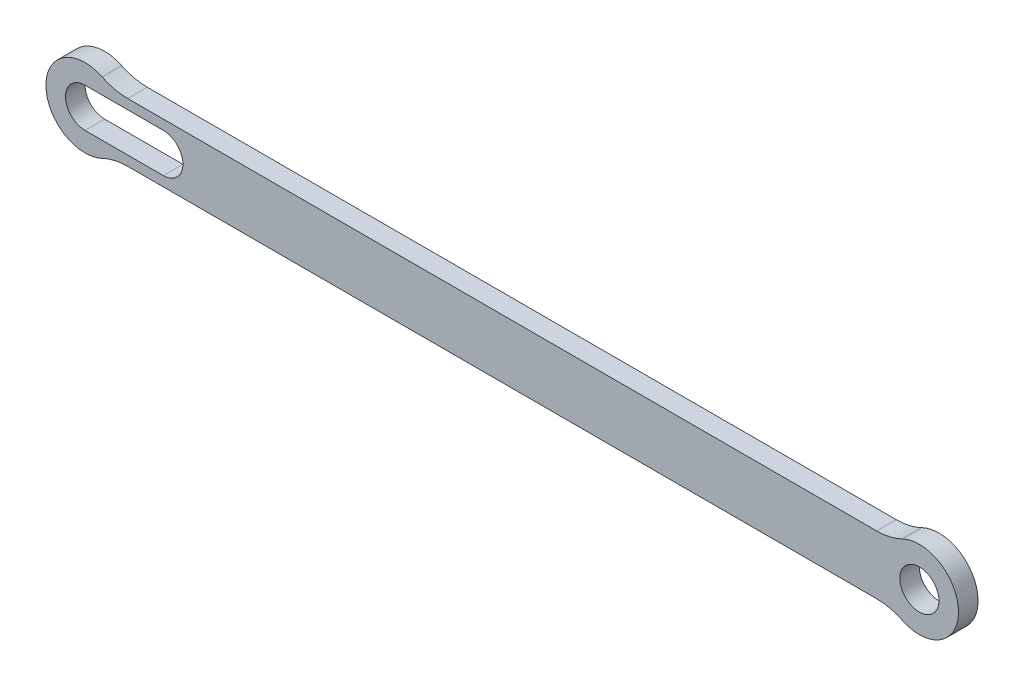
ISO-10303-21;
HEADER;
FILE_DESCRIPTION(('STEP AP214'),'2;1');
FILE_NAME('part.step','',(''),(''),'','','');
FILE_SCHEMA(('AUTOMOTIVE_DESIGN { 1 0 10303 214 1 1 1 1 }'));
ENDSEC;
DATA;
#1=APPLICATION_CONTEXT('core data for automotive mechanical design processes');
#2=APPLICATION_PROTOCOL_DEFINITION('international standard','automotive_design',2000,#1);
#3=PRODUCT_CONTEXT('',#1,'mechanical');
#4=PRODUCT('Part','Part','',(#3));
#5=PRODUCT_RELATED_PRODUCT_CATEGORY('part','',(#4));
#6=PRODUCT_DEFINITION_FORMATION('','',#4);
#7=PRODUCT_DEFINITION_CONTEXT('part definition',#1,'design');
#8=PRODUCT_DEFINITION('design','',#6,#7);
#9=PRODUCT_DEFINITION_SHAPE('','',#8);
#10=(LENGTH_UNIT() NAMED_UNIT(*) SI_UNIT(.MILLI.,.METRE.));
#11=(NAMED_UNIT(*) PLANE_ANGLE_UNIT() SI_UNIT($,.RADIAN.));
#12=(NAMED_UNIT(*) SI_UNIT($,.STERADIAN.) SOLID_ANGLE_UNIT());
#13=UNCERTAINTY_MEASURE_WITH_UNIT(LENGTH_MEASURE(1.E-05),#10,'distance_accuracy_value','');
#14=(GEOMETRIC_REPRESENTATION_CONTEXT(3) GLOBAL_UNCERTAINTY_ASSIGNED_CONTEXT((#13)) GLOBAL_UNIT_ASSIGNED_CONTEXT((#10,
#11,#12)) REPRESENTATION_CONTEXT('',''));
#15=CARTESIAN_POINT('',(0.,0.,0.));
#16=DIRECTION('',(0.,0.,1.));
#17=DIRECTION('',(1.,0.,0.));
#18=AXIS2_PLACEMENT_3D('',#15,#16,#17);
#19=CARTESIAN_POINT('',(-10.8972473588517,22.5,5.));
#20=DIRECTION('',(0.,0.,-1.));
#21=DIRECTION('',(-1.,0.,0.));
#22=AXIS2_PLACEMENT_3D('',#19,#20,#21);
#23=PLANE('',#22);
#24=CARTESIAN_POINT('',(0.,0.,5.));
#25=DIRECTION('',(0.,0.,1.));
#26=DIRECTION('',(1.,0.,0.));
#27=AXIS2_PLACEMENT_3D('',#24,#25,#26);
#28=CIRCLE('',#27,5.);
#29=CARTESIAN_POINT('',(5.,0.,5.));
#30=VERTEX_POINT('',#29);
#31=EDGE_CURVE('E161',#30,#30,#28,.T.);
#32=ORIENTED_EDGE('',*,*,#31,.F.);
#33=EDGE_LOOP('',(#32));
#34=FACE_BOUND('',#33,.T.);
#35=CARTESIAN_POINT('',(-10.8972473588517,22.5,5.));
#36=DIRECTION('',(0.,0.,-1.));
#37=DIRECTION('',(-1.,0.,0.));
#38=AXIS2_PLACEMENT_3D('',#35,#36,#37);
#39=CIRCLE('',#38,15.);
#40=CARTESIAN_POINT('',(-4.35889894354068,9.,5.));
#41=VERTEX_POINT('',#40);
#42=CARTESIAN_POINT('',(-10.8972473588517,7.5,5.));
#43=VERTEX_POINT('',#42);
#44=EDGE_CURVE('E167',#41,#43,#39,.T.);
#45=ORIENTED_EDGE('',*,*,#44,.T.);
#46=DIRECTION('',(-1.,0.,0.));
#47=VECTOR('',#46,1.);
#48=CARTESIAN_POINT('',(-202.232752641148,7.5,5.));
#49=LINE('',#48,#47);
#50=CARTESIAN_POINT('',(-202.232752641148,7.5,5.));
#51=VERTEX_POINT('',#50);
#52=EDGE_CURVE('E170',#43,#51,#49,.T.);
#53=ORIENTED_EDGE('',*,*,#52,.T.);
#54=CARTESIAN_POINT('',(-202.232752641148,22.5,5.));
#55=DIRECTION('',(0.,0.,-1.));
#56=DIRECTION('',(-1.,0.,0.));
#57=AXIS2_PLACEMENT_3D('',#54,#55,#56);
#58=CIRCLE('',#57,15.);
#59=CARTESIAN_POINT('',(-208.771101056459,9.,5.));
#60=VERTEX_POINT('',#59);
#61=EDGE_CURVE('E173',#51,#60,#58,.T.);
#62=ORIENTED_EDGE('',*,*,#61,.T.);
#63=CARTESIAN_POINT('',(-213.13,0.,5.));
#64=DIRECTION('',(0.,0.,1.));
#65=DIRECTION('',(1.,0.,0.));
#66=AXIS2_PLACEMENT_3D('',#63,#64,#65);
#67=CIRCLE('',#66,10.);
#68=CARTESIAN_POINT('',(-208.771101056459,-9.,5.));
#69=VERTEX_POINT('',#68);
#70=EDGE_CURVE('E175',#60,#69,#67,.T.);
#71=ORIENTED_EDGE('',*,*,#70,.T.);
#72=CARTESIAN_POINT('',(-202.232752641148,-22.5,5.));
#73=DIRECTION('',(0.,0.,-1.));
#74=DIRECTION('',(-1.,0.,0.));
#75=AXIS2_PLACEMENT_3D('',#72,#73,#74);
#76=CIRCLE('',#75,15.);
#77=CARTESIAN_POINT('',(-202.232752641148,-7.5,5.));
#78=VERTEX_POINT('',#77);
#79=EDGE_CURVE('E177',#69,#78,#76,.T.);
#80=ORIENTED_EDGE('',*,*,#79,.T.);
#81=DIRECTION('',(1.,0.,0.));
#82=VECTOR('',#81,1.);
#83=CARTESIAN_POINT('',(-202.232752641148,-7.5,5.));
#84=LINE('',#83,#82);
#85=CARTESIAN_POINT('',(-10.8972473588517,-7.5,5.));
#86=VERTEX_POINT('',#85);
#87=EDGE_CURVE('E179',#78,#86,#84,.T.);
#88=ORIENTED_EDGE('',*,*,#87,.T.);
#89=CARTESIAN_POINT('',(-10.8972473588517,-22.5,5.));
#90=DIRECTION('',(0.,0.,-1.));
#91=DIRECTION('',(1.,0.,0.));
#92=AXIS2_PLACEMENT_3D('',#89,#90,#91);
#93=CIRCLE('',#92,15.);
#94=CARTESIAN_POINT('',(-4.35889894354068,-9.,5.));
#95=VERTEX_POINT('',#94);
#96=EDGE_CURVE('E181',#86,#95,#93,.T.);
#97=ORIENTED_EDGE('',*,*,#96,.T.);
#98=CARTESIAN_POINT('',(0.,0.,5.));
#99=DIRECTION('',(0.,0.,1.));
#100=DIRECTION('',(1.,0.,0.));
#101=AXIS2_PLACEMENT_3D('',#98,#99,#100);
#102=CIRCLE('',#101,10.);
#103=EDGE_CURVE('E183',#95,#41,#102,.T.);
#104=ORIENTED_EDGE('',*,*,#103,.T.);
#105=EDGE_LOOP('',(#45,#53,#62,#71,#80,#88,#97,#104));
#106=FACE_BOUND('',#105,.T.);
#107=CARTESIAN_POINT('',(-213.13,0.,5.));
#108=DIRECTION('',(0.,0.,1.));
#109=DIRECTION('',(1.,0.,0.));
#110=AXIS2_PLACEMENT_3D('',#107,#108,#109);
#111=CIRCLE('',#110,5.);
#112=CARTESIAN_POINT('',(-213.13,5.,5.));
#113=VERTEX_POINT('',#112);
#114=CARTESIAN_POINT('',(-213.13,-5.,5.));
#115=VERTEX_POINT('',#114);
#116=EDGE_CURVE('E125',#113,#115,#111,.T.);
#117=ORIENTED_EDGE('',*,*,#116,.F.);
#118=DIRECTION('',(-1.,0.,0.));
#119=VECTOR('',#118,1.);
#120=CARTESIAN_POINT('',(-213.13,5.,5.));
#121=LINE('',#120,#119);
#122=CARTESIAN_POINT('',(-193.13,5.,5.));
#123=VERTEX_POINT('',#122);
#124=EDGE_CURVE('E147',#123,#113,#121,.T.);
#125=ORIENTED_EDGE('',*,*,#124,.F.);
#126=CARTESIAN_POINT('',(-193.13,0.,5.));
#127=DIRECTION('',(0.,0.,1.));
#128=DIRECTION('',(1.,0.,0.));
#129=AXIS2_PLACEMENT_3D('',#126,#127,#128);
#130=CIRCLE('',#129,5.);
#131=CARTESIAN_POINT('',(-193.13,-5.,5.));
#132=VERTEX_POINT('',#131);
#133=EDGE_CURVE('E145',#132,#123,#130,.T.);
#134=ORIENTED_EDGE('',*,*,#133,.F.);
#135=DIRECTION('',(1.,0.,0.));
#136=VECTOR('',#135,1.);
#137=CARTESIAN_POINT('',(-213.13,-5.,5.));
#138=LINE('',#137,#136);
#139=EDGE_CURVE('E133',#115,#132,#138,.T.);
#140=ORIENTED_EDGE('',*,*,#139,.F.);
#141=EDGE_LOOP('',(#117,#125,#134,#140));
#142=FACE_BOUND('',#141,.T.);
#143=ADVANCED_FACE('F36',(#34,#106,#142),#23,.F.);
#144=CARTESIAN_POINT('',(-10.8972473588517,22.5,0.));
#145=DIRECTION('',(0.,0.,-1.));
#146=DIRECTION('',(-1.,0.,0.));
#147=AXIS2_PLACEMENT_3D('',#144,#145,#146);
#148=PLANE('',#147);
#149=CARTESIAN_POINT('',(-10.8972473588517,22.5,0.));
#150=DIRECTION('',(0.,0.,-1.));
#151=DIRECTION('',(-1.,0.,0.));
#152=AXIS2_PLACEMENT_3D('',#149,#150,#151);
#153=CIRCLE('',#152,15.);
#154=CARTESIAN_POINT('',(-4.35889894354068,9.,0.));
#155=VERTEX_POINT('',#154);
#156=CARTESIAN_POINT('',(-10.8972473588517,7.5,0.));
#157=VERTEX_POINT('',#156);
#158=EDGE_CURVE('E164',#155,#157,#153,.T.);
#159=ORIENTED_EDGE('',*,*,#158,.F.);
#160=CARTESIAN_POINT('',(0.,0.,0.));
#161=DIRECTION('',(0.,0.,1.));
#162=DIRECTION('',(1.,0.,0.));
#163=AXIS2_PLACEMENT_3D('',#160,#161,#162);
#164=CIRCLE('',#163,10.);
#165=CARTESIAN_POINT('',(-4.35889894354068,-9.,0.));
#166=VERTEX_POINT('',#165);
#167=EDGE_CURVE('E171',#166,#155,#164,.T.);
#168=ORIENTED_EDGE('',*,*,#167,.F.);
#169=CARTESIAN_POINT('',(-10.8972473588517,-22.5,0.));
#170=DIRECTION('',(0.,0.,-1.));
#171=DIRECTION('',(1.,0.,0.));
#172=AXIS2_PLACEMENT_3D('',#169,#170,#171);
#173=CIRCLE('',#172,15.);
#174=CARTESIAN_POINT('',(-10.8972473588517,-7.5,0.));
#175=VERTEX_POINT('',#174);
#176=EDGE_CURVE('E198',#175,#166,#173,.T.);
#177=ORIENTED_EDGE('',*,*,#176,.F.);
#178=DIRECTION('',(1.,0.,0.));
#179=VECTOR('',#178,1.);
#180=CARTESIAN_POINT('',(-202.232752641148,-7.5,0.));
#181=LINE('',#180,#179);
#182=CARTESIAN_POINT('',(-202.232752641148,-7.5,0.));
#183=VERTEX_POINT('',#182);
#184=EDGE_CURVE('E196',#183,#175,#181,.T.);
#185=ORIENTED_EDGE('',*,*,#184,.F.);
#186=CARTESIAN_POINT('',(-202.232752641148,-22.5,0.));
#187=DIRECTION('',(0.,0.,-1.));
#188=DIRECTION('',(-1.,0.,0.));
#189=AXIS2_PLACEMENT_3D('',#186,#187,#188);
#190=CIRCLE('',#189,15.);
#191=CARTESIAN_POINT('',(-208.771101056459,-9.,0.));
#192=VERTEX_POINT('',#191);
#193=EDGE_CURVE('E194',#192,#183,#190,.T.);
#194=ORIENTED_EDGE('',*,*,#193,.F.);
#195=CARTESIAN_POINT('',(-213.13,0.,0.));
#196=DIRECTION('',(0.,0.,1.));
#197=DIRECTION('',(1.,0.,0.));
#198=AXIS2_PLACEMENT_3D('',#195,#196,#197);
#199=CIRCLE('',#198,10.);
#200=CARTESIAN_POINT('',(-208.771101056459,9.,0.));
#201=VERTEX_POINT('',#200);
#202=EDGE_CURVE('E192',#201,#192,#199,.T.);
#203=ORIENTED_EDGE('',*,*,#202,.F.);
#204=CARTESIAN_POINT('',(-202.232752641148,22.5,0.));
#205=DIRECTION('',(0.,0.,-1.));
#206=DIRECTION('',(-1.,0.,0.));
#207=AXIS2_PLACEMENT_3D('',#204,#205,#206);
#208=CIRCLE('',#207,15.);
#209=CARTESIAN_POINT('',(-202.232752641148,7.5,0.));
#210=VERTEX_POINT('',#209);
#211=EDGE_CURVE('E190',#210,#201,#208,.T.);
#212=ORIENTED_EDGE('',*,*,#211,.F.);
#213=DIRECTION('',(-1.,0.,0.));
#214=VECTOR('',#213,1.);
#215=CARTESIAN_POINT('',(-202.232752641148,7.5,0.));
#216=LINE('',#215,#214);
#217=EDGE_CURVE('E188',#157,#210,#216,.T.);
#218=ORIENTED_EDGE('',*,*,#217,.F.);
#219=EDGE_LOOP('',(#159,#168,#177,#185,#194,#203,#212,#218));
#220=FACE_BOUND('',#219,.T.);
#221=CARTESIAN_POINT('',(0.,0.,0.));
#222=DIRECTION('',(0.,0.,1.));
#223=DIRECTION('',(1.,0.,0.));
#224=AXIS2_PLACEMENT_3D('',#221,#222,#223);
#225=CIRCLE('',#224,5.);
#226=CARTESIAN_POINT('',(5.,0.,0.));
#227=VERTEX_POINT('',#226);
#228=EDGE_CURVE('E141',#227,#227,#225,.T.);
#229=ORIENTED_EDGE('',*,*,#228,.T.);
#230=EDGE_LOOP('',(#229));
#231=FACE_BOUND('',#230,.T.);
#232=DIRECTION('',(-1.,0.,0.));
#233=VECTOR('',#232,1.);
#234=CARTESIAN_POINT('',(-213.13,5.,0.));
#235=LINE('',#234,#233);
#236=CARTESIAN_POINT('',(-193.13,5.,0.));
#237=VERTEX_POINT('',#236);
#238=CARTESIAN_POINT('',(-213.13,5.,0.));
#239=VERTEX_POINT('',#238);
#240=EDGE_CURVE('E134',#237,#239,#235,.T.);
#241=ORIENTED_EDGE('',*,*,#240,.T.);
#242=CARTESIAN_POINT('',(-213.13,0.,0.));
#243=DIRECTION('',(0.,0.,1.));
#244=DIRECTION('',(1.,0.,0.));
#245=AXIS2_PLACEMENT_3D('',#242,#243,#244);
#246=CIRCLE('',#245,5.);
#247=CARTESIAN_POINT('',(-213.13,-5.,0.));
#248=VERTEX_POINT('',#247);
#249=EDGE_CURVE('E59',#239,#248,#246,.T.);
#250=ORIENTED_EDGE('',*,*,#249,.T.);
#251=DIRECTION('',(1.,0.,0.));
#252=VECTOR('',#251,1.);
#253=CARTESIAN_POINT('',(-213.13,-5.,0.));
#254=LINE('',#253,#252);
#255=CARTESIAN_POINT('',(-193.13,-5.,0.));
#256=VERTEX_POINT('',#255);
#257=EDGE_CURVE('E140',#248,#256,#254,.T.);
#258=ORIENTED_EDGE('',*,*,#257,.T.);
#259=CARTESIAN_POINT('',(-193.13,0.,0.));
#260=DIRECTION('',(0.,0.,1.));
#261=DIRECTION('',(1.,0.,0.));
#262=AXIS2_PLACEMENT_3D('',#259,#260,#261);
#263=CIRCLE('',#262,5.);
#264=EDGE_CURVE('E153',#256,#237,#263,.T.);
#265=ORIENTED_EDGE('',*,*,#264,.T.);
#266=EDGE_LOOP('',(#241,#250,#258,#265));
#267=FACE_BOUND('',#266,.T.);
#268=ADVANCED_FACE('F228',(#220,#231,#267),#148,.T.);
#269=CARTESIAN_POINT('',(-10.8972473588517,22.5,5.));
#270=DIRECTION('',(0.,0.,-1.));
#271=DIRECTION('',(-1.,0.,0.));
#272=AXIS2_PLACEMENT_3D('',#269,#270,#271);
#273=CYLINDRICAL_SURFACE('',#272,15.);
#274=ORIENTED_EDGE('',*,*,#158,.T.);
#275=DIRECTION('',(0.,0.,-1.));
#276=VECTOR('',#275,1.);
#277=CARTESIAN_POINT('',(-10.8972473588517,7.5,5.));
#278=LINE('',#277,#276);
#279=EDGE_CURVE('E11',#43,#157,#278,.T.);
#280=ORIENTED_EDGE('',*,*,#279,.F.);
#281=ORIENTED_EDGE('',*,*,#44,.F.);
#282=DIRECTION('',(0.,0.,-1.));
#283=VECTOR('',#282,1.);
#284=CARTESIAN_POINT('',(-4.35889894354068,9.,5.));
#285=LINE('',#284,#283);
#286=EDGE_CURVE('E185',#41,#155,#285,.T.);
#287=ORIENTED_EDGE('',*,*,#286,.T.);
#288=EDGE_LOOP('',(#274,#280,#281,#287));
#289=FACE_BOUND('',#288,.T.);
#290=ADVANCED_FACE('F38',(#289),#273,.F.);
#291=CARTESIAN_POINT('',(-202.232752641148,7.5,5.));
#292=DIRECTION('',(0.,-1.,0.));
#293=DIRECTION('',(0.,0.,-1.));
#294=AXIS2_PLACEMENT_3D('',#291,#292,#293);
#295=PLANE('',#294);
#296=ORIENTED_EDGE('',*,*,#217,.T.);
#297=DIRECTION('',(0.,0.,-1.));
#298=VECTOR('',#297,1.);
#299=CARTESIAN_POINT('',(-202.232752641148,7.5,5.));
#300=LINE('',#299,#298);
#301=EDGE_CURVE('E44',#51,#210,#300,.T.);
#302=ORIENTED_EDGE('',*,*,#301,.F.);
#303=ORIENTED_EDGE('',*,*,#52,.F.);
#304=ORIENTED_EDGE('',*,*,#279,.T.);
#305=EDGE_LOOP('',(#296,#302,#303,#304));
#306=FACE_BOUND('',#305,.T.);
#307=ADVANCED_FACE('F245',(#306),#295,.F.);
#308=CARTESIAN_POINT('',(-202.232752641148,22.5,5.));
#309=DIRECTION('',(0.,0.,-1.));
#310=DIRECTION('',(-1.,0.,0.));
#311=AXIS2_PLACEMENT_3D('',#308,#309,#310);
#312=CYLINDRICAL_SURFACE('',#311,15.);
#313=ORIENTED_EDGE('',*,*,#211,.T.);
#314=DIRECTION('',(0.,0.,-1.));
#315=VECTOR('',#314,1.);
#316=CARTESIAN_POINT('',(-208.771101056459,9.,5.));
#317=LINE('',#316,#315);
#318=EDGE_CURVE('E215',#60,#201,#317,.T.);
#319=ORIENTED_EDGE('',*,*,#318,.F.);
#320=ORIENTED_EDGE('',*,*,#61,.F.);
#321=ORIENTED_EDGE('',*,*,#301,.T.);
#322=EDGE_LOOP('',(#313,#319,#320,#321));
#323=FACE_BOUND('',#322,.T.);
#324=ADVANCED_FACE('F222',(#323),#312,.F.);
#325=CARTESIAN_POINT('',(-213.13,0.,5.));
#326=DIRECTION('',(0.,0.,-1.));
#327=DIRECTION('',(-1.,0.,0.));
#328=AXIS2_PLACEMENT_3D('',#325,#326,#327);
#329=CYLINDRICAL_SURFACE('',#328,10.);
#330=ORIENTED_EDGE('',*,*,#202,.T.);
#331=DIRECTION('',(0.,0.,-1.));
#332=VECTOR('',#331,1.);
#333=CARTESIAN_POINT('',(-208.771101056459,-9.,5.));
#334=LINE('',#333,#332);
#335=EDGE_CURVE('E212',#69,#192,#334,.T.);
#336=ORIENTED_EDGE('',*,*,#335,.F.);
#337=ORIENTED_EDGE('',*,*,#70,.F.);
#338=ORIENTED_EDGE('',*,*,#318,.T.);
#339=EDGE_LOOP('',(#330,#336,#337,#338));
#340=FACE_BOUND('',#339,.T.);
#341=ADVANCED_FACE('F234',(#340),#329,.T.);
#342=CARTESIAN_POINT('',(-202.232752641148,-22.5,5.));
#343=DIRECTION('',(0.,0.,-1.));
#344=DIRECTION('',(-1.,0.,0.));
#345=AXIS2_PLACEMENT_3D('',#342,#343,#344);
#346=CYLINDRICAL_SURFACE('',#345,15.);
#347=ORIENTED_EDGE('',*,*,#193,.T.);
#348=DIRECTION('',(0.,0.,-1.));
#349=VECTOR('',#348,1.);
#350=CARTESIAN_POINT('',(-202.232752641148,-7.5,5.));
#351=LINE('',#350,#349);
#352=EDGE_CURVE('E209',#78,#183,#351,.T.);
#353=ORIENTED_EDGE('',*,*,#352,.F.);
#354=ORIENTED_EDGE('',*,*,#79,.F.);
#355=ORIENTED_EDGE('',*,*,#335,.T.);
#356=EDGE_LOOP('',(#347,#353,#354,#355));
#357=FACE_BOUND('',#356,.T.);
#358=ADVANCED_FACE('F238',(#357),#346,.F.);
#359=CARTESIAN_POINT('',(-202.232752641148,-7.5,5.));
#360=DIRECTION('',(0.,1.,0.));
#361=DIRECTION('',(0.,0.,1.));
#362=AXIS2_PLACEMENT_3D('',#359,#360,#361);
#363=PLANE('',#362);
#364=ORIENTED_EDGE('',*,*,#184,.T.);
#365=DIRECTION('',(0.,0.,-1.));
#366=VECTOR('',#365,1.);
#367=CARTESIAN_POINT('',(-10.8972473588517,-7.5,5.));
#368=LINE('',#367,#366);
#369=EDGE_CURVE('E206',#86,#175,#368,.T.);
#370=ORIENTED_EDGE('',*,*,#369,.F.);
#371=ORIENTED_EDGE('',*,*,#87,.F.);
#372=ORIENTED_EDGE('',*,*,#352,.T.);
#373=EDGE_LOOP('',(#364,#370,#371,#372));
#374=FACE_BOUND('',#373,.T.);
#375=ADVANCED_FACE('F258',(#374),#363,.F.);
#376=CARTESIAN_POINT('',(-10.8972473588517,-22.5,5.));
#377=DIRECTION('',(0.,0.,-1.));
#378=DIRECTION('',(-1.,0.,0.));
#379=AXIS2_PLACEMENT_3D('',#376,#377,#378);
#380=CYLINDRICAL_SURFACE('',#379,15.);
#381=ORIENTED_EDGE('',*,*,#176,.T.);
#382=DIRECTION('',(0.,0.,-1.));
#383=VECTOR('',#382,1.);
#384=CARTESIAN_POINT('',(-4.35889894354068,-9.,5.));
#385=LINE('',#384,#383);
#386=EDGE_CURVE('E203',#95,#166,#385,.T.);
#387=ORIENTED_EDGE('',*,*,#386,.F.);
#388=ORIENTED_EDGE('',*,*,#96,.F.);
#389=ORIENTED_EDGE('',*,*,#369,.T.);
#390=EDGE_LOOP('',(#381,#387,#388,#389));
#391=FACE_BOUND('',#390,.T.);
#392=ADVANCED_FACE('F256',(#391),#380,.F.);
#393=CARTESIAN_POINT('',(0.,0.,5.));
#394=DIRECTION('',(0.,0.,-1.));
#395=DIRECTION('',(-1.,0.,0.));
#396=AXIS2_PLACEMENT_3D('',#393,#394,#395);
#397=CYLINDRICAL_SURFACE('',#396,10.);
#398=ORIENTED_EDGE('',*,*,#167,.T.);
#399=ORIENTED_EDGE('',*,*,#286,.F.);
#400=ORIENTED_EDGE('',*,*,#103,.F.);
#401=ORIENTED_EDGE('',*,*,#386,.T.);
#402=EDGE_LOOP('',(#398,#399,#400,#401));
#403=FACE_BOUND('',#402,.T.);
#404=ADVANCED_FACE('F251',(#403),#397,.T.);
#405=CARTESIAN_POINT('',(0.,0.,5.));
#406=DIRECTION('',(0.,0.,-1.));
#407=DIRECTION('',(-1.,0.,0.));
#408=AXIS2_PLACEMENT_3D('',#405,#406,#407);
#409=CYLINDRICAL_SURFACE('',#408,5.);
#410=ORIENTED_EDGE('',*,*,#31,.T.);
#411=EDGE_LOOP('',(#410));
#412=FACE_BOUND('',#411,.T.);
#413=ORIENTED_EDGE('',*,*,#228,.F.);
#414=EDGE_LOOP('',(#413));
#415=FACE_BOUND('',#414,.T.);
#416=ADVANCED_FACE('F276',(#412,#415),#409,.F.);
#417=CARTESIAN_POINT('',(-213.13,0.,5.));
#418=DIRECTION('',(0.,0.,-1.));
#419=DIRECTION('',(-1.,0.,0.));
#420=AXIS2_PLACEMENT_3D('',#417,#418,#419);
#421=CYLINDRICAL_SURFACE('',#420,5.);
#422=ORIENTED_EDGE('',*,*,#249,.F.);
#423=DIRECTION('',(0.,0.,-1.));
#424=VECTOR('',#423,1.);
#425=CARTESIAN_POINT('',(-213.13,5.,5.));
#426=LINE('',#425,#424);
#427=EDGE_CURVE('E129',#113,#239,#426,.T.);
#428=ORIENTED_EDGE('',*,*,#427,.F.);
#429=ORIENTED_EDGE('',*,*,#116,.T.);
#430=DIRECTION('',(0.,0.,-1.));
#431=VECTOR('',#430,1.);
#432=CARTESIAN_POINT('',(-213.13,-5.,5.));
#433=LINE('',#432,#431);
#434=EDGE_CURVE('E128',#115,#248,#433,.T.);
#435=ORIENTED_EDGE('',*,*,#434,.T.);
#436=EDGE_LOOP('',(#422,#428,#429,#435));
#437=FACE_BOUND('',#436,.T.);
#438=ADVANCED_FACE('F127',(#437),#421,.F.);
#439=CARTESIAN_POINT('',(-213.13,-5.,5.));
#440=DIRECTION('',(0.,1.,0.));
#441=DIRECTION('',(0.,0.,1.));
#442=AXIS2_PLACEMENT_3D('',#439,#440,#441);
#443=PLANE('',#442);
#444=ORIENTED_EDGE('',*,*,#257,.F.);
#445=ORIENTED_EDGE('',*,*,#434,.F.);
#446=ORIENTED_EDGE('',*,*,#139,.T.);
#447=DIRECTION('',(0.,0.,-1.));
#448=VECTOR('',#447,1.);
#449=CARTESIAN_POINT('',(-193.13,-5.,5.));
#450=LINE('',#449,#448);
#451=EDGE_CURVE('E142',#132,#256,#450,.T.);
#452=ORIENTED_EDGE('',*,*,#451,.T.);
#453=EDGE_LOOP('',(#444,#445,#446,#452));
#454=FACE_BOUND('',#453,.T.);
#455=ADVANCED_FACE('F137',(#454),#443,.T.);
#456=CARTESIAN_POINT('',(-193.13,0.,5.));
#457=DIRECTION('',(0.,0.,-1.));
#458=DIRECTION('',(-1.,0.,0.));
#459=AXIS2_PLACEMENT_3D('',#456,#457,#458);
#460=CYLINDRICAL_SURFACE('',#459,5.);
#461=ORIENTED_EDGE('',*,*,#264,.F.);
#462=ORIENTED_EDGE('',*,*,#451,.F.);
#463=ORIENTED_EDGE('',*,*,#133,.T.);
#464=DIRECTION('',(0.,0.,-1.));
#465=VECTOR('',#464,1.);
#466=CARTESIAN_POINT('',(-193.13,5.,5.));
#467=LINE('',#466,#465);
#468=EDGE_CURVE('E51',#123,#237,#467,.T.);
#469=ORIENTED_EDGE('',*,*,#468,.T.);
#470=EDGE_LOOP('',(#461,#462,#463,#469));
#471=FACE_BOUND('',#470,.T.);
#472=ADVANCED_FACE('F293',(#471),#460,.F.);
#473=CARTESIAN_POINT('',(-213.13,5.,5.));
#474=DIRECTION('',(0.,-1.,0.));
#475=DIRECTION('',(0.,0.,-1.));
#476=AXIS2_PLACEMENT_3D('',#473,#474,#475);
#477=PLANE('',#476);
#478=ORIENTED_EDGE('',*,*,#240,.F.);
#479=ORIENTED_EDGE('',*,*,#468,.F.);
#480=ORIENTED_EDGE('',*,*,#124,.T.);
#481=ORIENTED_EDGE('',*,*,#427,.T.);
#482=EDGE_LOOP('',(#478,#479,#480,#481));
#483=FACE_BOUND('',#482,.T.);
#484=ADVANCED_FACE('F291',(#483),#477,.T.);
#485=CLOSED_SHELL('',(#143,#268,#290,#307,#324,#341,#358,#375,#392,#404,#416,#438,#455,#472,#484));
#486=MANIFOLD_SOLID_BREP('B2',#485);
#487=ADVANCED_BREP_SHAPE_REPRESENTATION('',(#18,#486),#14);
#488=SHAPE_DEFINITION_REPRESENTATION(#9,#487);
ENDSEC;
END-ISO-10303-21;
